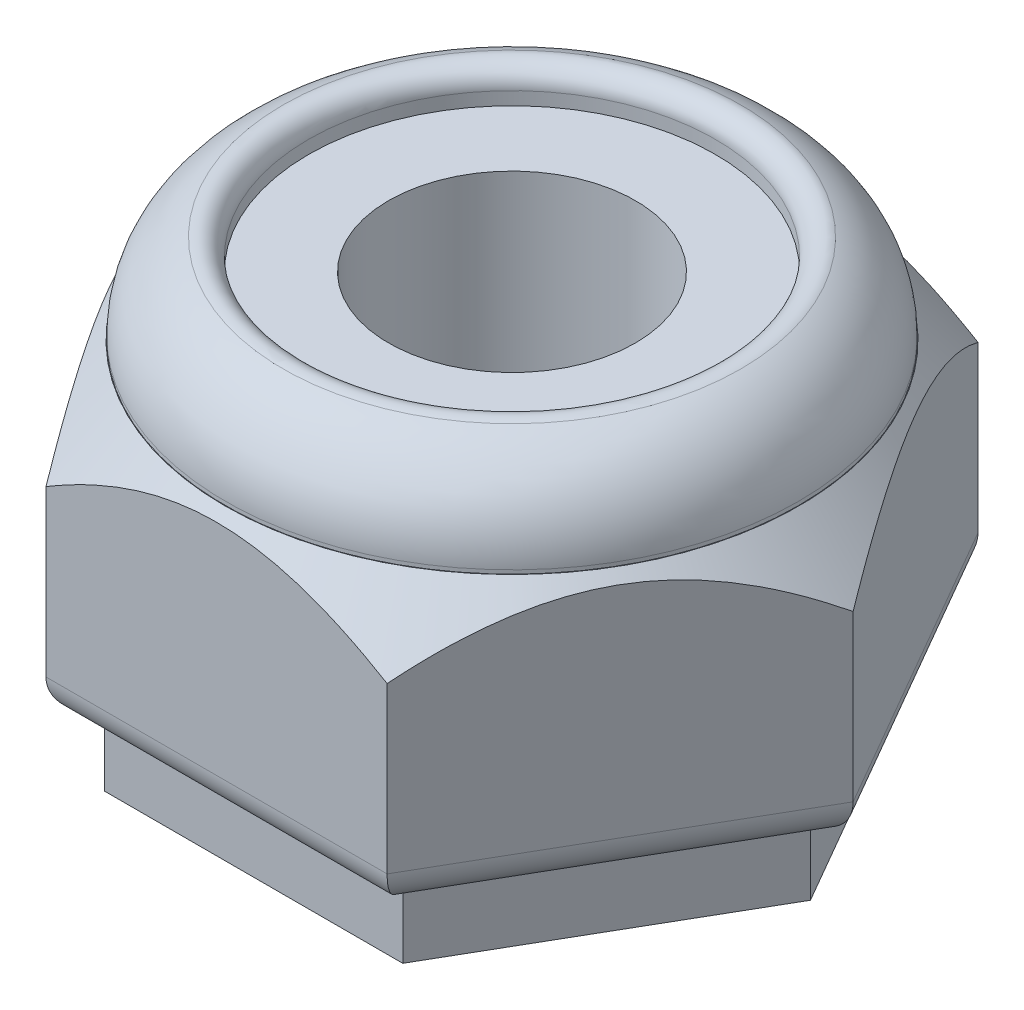
ISO-10303-21;
HEADER;
FILE_DESCRIPTION(('STEP AP214'),'2;1');
FILE_NAME('part.step','',(''),(''),'','','');
FILE_SCHEMA(('AUTOMOTIVE_DESIGN { 1 0 10303 214 1 1 1 1 }'));
ENDSEC;
DATA;
#1=APPLICATION_CONTEXT('core data for automotive mechanical design processes');
#2=APPLICATION_PROTOCOL_DEFINITION('international standard','automotive_design',2000,#1);
#3=PRODUCT_CONTEXT('',#1,'mechanical');
#4=PRODUCT('Part','Part','',(#3));
#5=PRODUCT_RELATED_PRODUCT_CATEGORY('part','',(#4));
#6=PRODUCT_DEFINITION_FORMATION('','',#4);
#7=PRODUCT_DEFINITION_CONTEXT('part definition',#1,'design');
#8=PRODUCT_DEFINITION('design','',#6,#7);
#9=PRODUCT_DEFINITION_SHAPE('','',#8);
#10=(LENGTH_UNIT() NAMED_UNIT(*) SI_UNIT(.MILLI.,.METRE.));
#11=(NAMED_UNIT(*) PLANE_ANGLE_UNIT() SI_UNIT($,.RADIAN.));
#12=(NAMED_UNIT(*) SI_UNIT($,.STERADIAN.) SOLID_ANGLE_UNIT());
#13=UNCERTAINTY_MEASURE_WITH_UNIT(LENGTH_MEASURE(1.E-05),#10,'distance_accuracy_value','');
#14=(GEOMETRIC_REPRESENTATION_CONTEXT(3) GLOBAL_UNCERTAINTY_ASSIGNED_CONTEXT((#13)) GLOBAL_UNIT_ASSIGNED_CONTEXT((#10,
#11,#12)) REPRESENTATION_CONTEXT('',''));
#15=CARTESIAN_POINT('',(0.,0.,0.));
#16=DIRECTION('',(0.,0.,1.));
#17=DIRECTION('',(1.,0.,0.));
#18=AXIS2_PLACEMENT_3D('',#15,#16,#17);
#19=CARTESIAN_POINT('',(0.,4.97840000000001,0.));
#20=DIRECTION('',(0.,-1.,0.));
#21=DIRECTION('',(1.,0.,0.));
#22=AXIS2_PLACEMENT_3D('',#19,#20,#21);
#23=CYLINDRICAL_SURFACE('',#22,3.93700000000001);
#24=CARTESIAN_POINT('',(0.,3.7084,0.));
#25=DIRECTION('',(0.,1.,0.));
#26=DIRECTION('',(-1.,0.,0.));
#27=AXIS2_PLACEMENT_3D('',#24,#25,#26);
#28=CIRCLE('',#27,3.937);
#29=CARTESIAN_POINT('',(-3.937,3.7084,0.));
#30=VERTEX_POINT('',#29);
#31=EDGE_CURVE('E144',#30,#30,#28,.T.);
#32=ORIENTED_EDGE('',*,*,#31,.F.);
#33=EDGE_LOOP('',(#32));
#34=FACE_BOUND('',#33,.T.);
#35=CARTESIAN_POINT('',(0.,3.6576,0.));
#36=DIRECTION('',(0.,-1.,0.));
#37=DIRECTION('',(1.,0.,0.));
#38=AXIS2_PLACEMENT_3D('',#35,#36,#37);
#39=CIRCLE('',#38,3.93700000000001);
#40=CARTESIAN_POINT('',(3.93700000000001,3.6576,0.));
#41=VERTEX_POINT('',#40);
#42=EDGE_CURVE('E22',#41,#41,#39,.F.);
#43=ORIENTED_EDGE('',*,*,#42,.T.);
#44=EDGE_LOOP('',(#43));
#45=FACE_BOUND('',#44,.T.);
#46=ADVANCED_FACE('F18',(#34,#45),#23,.T.);
#47=CARTESIAN_POINT('',(2.34315000000001,3.6576,4.05845484975502));
#48=DIRECTION('',(0.,-1.,0.));
#49=DIRECTION('',(1.,0.,0.));
#50=AXIS2_PLACEMENT_3D('',#47,#48,#49);
#51=PLANE('',#50);
#52=CARTESIAN_POINT('',(0.,3.65760000011051,0.));
#53=DIRECTION('',(0.,-1.,0.));
#54=DIRECTION('',(0.,0.,-1.));
#55=AXIS2_PLACEMENT_3D('',#52,#53,#54);
#56=CIRCLE('',#55,3.94407100941407);
#57=CARTESIAN_POINT('',(0.,3.65760000011051,-3.94407100941407));
#58=VERTEX_POINT('',#57);
#59=EDGE_CURVE('E143',#58,#58,#56,.T.);
#60=ORIENTED_EDGE('',*,*,#59,.F.);
#61=EDGE_LOOP('',(#60));
#62=FACE_BOUND('',#61,.T.);
#63=ORIENTED_EDGE('',*,*,#42,.F.);
#64=EDGE_LOOP('',(#63));
#65=FACE_BOUND('',#64,.T.);
#66=ADVANCED_FACE('F200',(#62,#65),#51,.F.);
#67=CARTESIAN_POINT('',(0.,3.70840000000008,0.));
#68=DIRECTION('',(0.,1.,0.));
#69=DIRECTION('',(0.,0.,1.));
#70=AXIS2_PLACEMENT_3D('',#67,#68,#69);
#71=TOROIDAL_SURFACE('',#70,2.66699999999999,1.27000000000001);
#72=ORIENTED_EDGE('',*,*,#31,.T.);
#73=EDGE_LOOP('',(#72));
#74=FACE_BOUND('',#73,.T.);
#75=CARTESIAN_POINT('',(0.,4.88572150982652,0.));
#76=DIRECTION('',(0.,1.,0.));
#77=DIRECTION('',(-1.,0.,0.));
#78=AXIS2_PLACEMENT_3D('',#75,#76,#77);
#79=CIRCLE('',#78,3.14325000000004);
#80=CARTESIAN_POINT('',(-3.14325000000003,4.88572150982652,0.));
#81=VERTEX_POINT('',#80);
#82=EDGE_CURVE('E123',#81,#81,#79,.T.);
#83=ORIENTED_EDGE('',*,*,#82,.F.);
#84=EDGE_LOOP('',(#83));
#85=FACE_BOUND('',#84,.T.);
#86=ADVANCED_FACE('F197',(#74,#85),#71,.T.);
#87=CARTESIAN_POINT('',(0.,2.76773860957746,0.));
#88=DIRECTION('',(0.,-1.,0.));
#89=DIRECTION('',(0.,0.,-1.));
#90=AXIS2_PLACEMENT_3D('',#87,#88,#89);
#91=CONICAL_SURFACE('',#90,4.69075337400682,0.698131700796127);
#92=CARTESIAN_POINT('',(-4.6863000000114,2.77304593403351,-2.25320317794357E-11));
#93=CARTESIAN_POINT('',(-4.65177717140758,2.81418235893236,0.0597952931420458));
#94=CARTESIAN_POINT('',(-4.61695780287667,2.85432113114669,0.120104208525791));
#95=CARTESIAN_POINT('',(-4.54666264440062,2.93230661024616,0.241858994532976));
#96=CARTESIAN_POINT('',(-4.51118655193285,2.97015222465668,0.303305389140977));
#97=CARTESIAN_POINT('',(-4.40329561884371,3.0801870150367,0.490177966927094));
#98=CARTESIAN_POINT('',(-4.32983334003595,3.14837015579584,0.617418366262069));
#99=CARTESIAN_POINT('',(-4.17977964996728,3.27092778612679,0.877318981324308));
#100=CARTESIAN_POINT('',(-4.10317943932015,3.32525984889778,1.00999443803558));
#101=CARTESIAN_POINT('',(-3.94747591651203,3.41577217649151,1.27968085045666));
#102=CARTESIAN_POINT('',(-3.86837998243798,3.4520014301635,1.41667902694504));
#103=CARTESIAN_POINT('',(-3.73746585196503,3.49372811246488,1.64342895235291));
#104=CARTESIAN_POINT('',(-3.68614686019892,3.50560413718322,1.73231605348501));
#105=CARTESIAN_POINT('',(-3.58316406709111,3.52008140705907,1.91068748345309));
#106=CARTESIAN_POINT('',(-3.53150020834685,3.52268106756209,2.00017191171322));
#107=CARTESIAN_POINT('',(-3.42855034551883,3.51847006527959,2.17848630476359));
#108=CARTESIAN_POINT('',(-3.37726380886124,3.51171021121524,2.26731719199878));
#109=CARTESIAN_POINT('',(-3.27519197709903,3.48921023558751,2.44411079063256));
#110=CARTESIAN_POINT('',(-3.22440670716081,3.47346966545127,2.53207345844164));
#111=CARTESIAN_POINT('',(-3.10963060135703,3.42817062225707,2.7308715051887));
#112=CARTESIAN_POINT('',(-3.0458989957849,3.395985420798,2.84125788408757));
#113=CARTESIAN_POINT('',(-2.92018166741256,3.32004827850177,3.05900668422027));
#114=CARTESIAN_POINT('',(-2.8581969196393,3.27629001419119,3.16636741665791));
#115=CARTESIAN_POINT('',(-2.73588906831862,3.17910361391332,3.3782108293099));
#116=CARTESIAN_POINT('',(-2.67557364740323,3.12563730736463,3.48268020281526));
#117=CARTESIAN_POINT('',(-2.55683004322896,3.01104764614135,3.68835015831895));
#118=CARTESIAN_POINT('',(-2.49840123092182,2.94992687754383,3.78955182986082));
#119=CARTESIAN_POINT('',(-2.42439626094935,2.86741854630126,3.91773219786575));
#120=CARTESIAN_POINT('',(-2.40802320108784,2.84883596653484,3.94609116942125));
#121=CARTESIAN_POINT('',(-2.37546215764895,2.81125673911755,4.00248855100485));
#122=CARTESIAN_POINT('',(-2.35927376443318,2.7922615116575,4.03052767054747));
#123=CARTESIAN_POINT('',(-2.34314999998725,2.77304593403407,4.0584548497771));
#124=B_SPLINE_CURVE_WITH_KNOTS('',3,(#92,#93,#94,#95,#96,#97,#98,#99,#100,#101,#102,#103,#104,
#105,#106,#107,#108,#109,#110,#111,#112,#113,#114,#115,#116,#117,#118,#119,#120,#121,#122,#123),
.UNSPECIFIED.,.F.,.F.,(4,2,2,2,2,2,2,2,2,2,2,2,2,2,2,4),(0.,0.241096809083664,0.482307589442793,
0.967637153828087,1.45443592239967,1.93991010953216,2.24950193429434,2.55914664320212,
2.86711700066345,3.175102742114,3.56882084705011,3.96275452396107,4.35827201922661,
4.75365624670312,4.86660838975017,4.97921936898528),.UNSPECIFIED.);
#125=CARTESIAN_POINT('',(-4.68630000001355,2.77304593403312,1.36271423806302E-12));
#126=VERTEX_POINT('',#125);
#127=CARTESIAN_POINT('',(-2.34314999999362,2.77304593404168,4.05845484976606));
#128=VERTEX_POINT('',#127);
#129=EDGE_CURVE('E109',#126,#128,#124,.T.);
#130=ORIENTED_EDGE('',*,*,#129,.T.);
#131=CARTESIAN_POINT('',(-2.34315000002808,2.77304593403118,4.05845484975238));
#132=CARTESIAN_POINT('',(-2.27415972167844,2.81414935275283,4.05845484975403));
#133=CARTESIAN_POINT('',(-2.20457738519557,2.85425669888465,4.05845484975473));
#134=CARTESIAN_POINT('',(-2.06410193525847,2.93218331971731,4.05845484975526));
#135=CARTESIAN_POINT('',(-1.99320821639063,2.97000150134924,4.05845484975509));
#136=CARTESIAN_POINT('',(-1.77754688770801,3.0799908638983,4.05845484975481));
#137=CARTESIAN_POINT('',(-1.63068545868604,3.1481589404029,4.05845484975493));
#138=CARTESIAN_POINT('',(-1.3305275245716,3.27077676922337,4.05845484975507));
#139=CARTESIAN_POINT('',(-1.17720631608808,3.32516696807218,4.05845484975508));
#140=CARTESIAN_POINT('',(-0.865613503807899,3.41574608769028,4.05845484975491));
#141=CARTESIAN_POINT('',(-0.70735922931479,3.45199244877867,4.05845484975473));
#142=CARTESIAN_POINT('',(-0.456822143349791,3.49192146549892,4.05845484975515));
#143=CARTESIAN_POINT('',(-0.365672921159959,3.50290887298616,4.05845484975545));
#144=CARTESIAN_POINT('',(-0.183016322006344,3.51758027916804,4.05845484975455));
#145=CARTESIAN_POINT('',(-0.0915105175260117,3.52128341040286,4.05845484975336));
#146=CARTESIAN_POINT('',(0.104649468641685,3.52128177495004,4.05845484975317));
#147=CARTESIAN_POINT('',(0.209305100872509,3.51643705336781,4.05845484975451));
#148=CARTESIAN_POINT('',(0.4177871819109,3.49730239563263,4.05845484975549));
#149=CARTESIAN_POINT('',(0.521613181354208,3.48300765114723,4.05845484975513));
#150=CARTESIAN_POINT('',(0.728332544915475,3.44553375889264,4.05845484975487));
#151=CARTESIAN_POINT('',(0.831215331560758,3.42229697727172,4.05845484975496));
#152=CARTESIAN_POINT('',(1.03487580391396,3.36791830057568,4.05845484975503));
#153=CARTESIAN_POINT('',(1.13565289469103,3.33677420324552,4.05845484975501));
#154=CARTESIAN_POINT('',(1.33273383822212,3.2683874192087,4.05845484975499));
#155=CARTESIAN_POINT('',(1.42908716225822,3.23128582687484,4.058454849755));
#156=CARTESIAN_POINT('',(1.61947291707581,3.1515107159495,4.058454849755));
#157=CARTESIAN_POINT('',(1.71350470708827,3.10883567902456,4.058454849755));
#158=CARTESIAN_POINT('',(1.89803195380911,3.01941532334896,4.058454849755));
#159=CARTESIAN_POINT('',(1.98855798044697,2.97273255729397,4.058454849755));
#160=CARTESIAN_POINT('',(2.16742834955933,2.87556944088041,4.058454849755));
#161=CARTESIAN_POINT('',(2.25577492889981,2.82509321935966,4.058454849755));
#162=CARTESIAN_POINT('',(2.3431500000285,2.7730459340323,4.058454849755));
#163=B_SPLINE_CURVE_WITH_KNOTS('',3,(#131,#132,#133,#134,#135,#136,#137,#138,#139,#140,#141,
#142,#143,#144,#145,#146,#147,#148,#149,#150,#151,#152,#153,#154,#155,#156,#157,#158,#159,#160,
#161,#162),.UNSPECIFIED.,.F.,.F.,(4,2,2,2,2,2,2,2,2,2,2,2,2,2,2,4),(0.,0.240903303554711,
0.481920744726708,0.967059466949703,1.45426068372302,1.93990959173642,2.2150793469257,
2.4895253838648,2.80337599593601,3.11738642357659,3.43345557969779,3.74961286052927,
4.05916118103853,4.36879400616134,4.67425708540958,4.97939238062303),.UNSPECIFIED.);
#164=CARTESIAN_POINT('',(2.34315000000798,2.77304593403312,4.05845484976606));
#165=VERTEX_POINT('',#164);
#166=EDGE_CURVE('E177',#128,#165,#163,.T.);
#167=ORIENTED_EDGE('',*,*,#166,.T.);
#168=CARTESIAN_POINT('',(2.34314999998621,2.77304593403353,4.05845484977614));
#169=CARTESIAN_POINT('',(2.37767282859156,2.81418235893238,3.99865955661244));
#170=CARTESIAN_POINT('',(2.41249219712311,2.8543211311467,3.93835064122907));
#171=CARTESIAN_POINT('',(2.48278735559964,2.93230661024616,3.81659585522216));
#172=CARTESIAN_POINT('',(2.51826344806725,2.97015222465669,3.75514946061407));
#173=CARTESIAN_POINT('',(2.62615438115614,3.08018701503671,3.56827688282781));
#174=CARTESIAN_POINT('',(2.69961665996402,3.14837015579585,3.44103648349291));
#175=CARTESIAN_POINT('',(2.84967035003279,3.27092778612679,3.18113586843073));
#176=CARTESIAN_POINT('',(2.92627056067988,3.32525984889778,3.04846041171944));
#177=CARTESIAN_POINT('',(3.08197408348797,3.41577217649151,2.77877399929834));
#178=CARTESIAN_POINT('',(3.16107001756203,3.4520014301635,2.64177582280997));
#179=CARTESIAN_POINT('',(3.29198414803499,3.49372811246488,2.4150258974021));
#180=CARTESIAN_POINT('',(3.34330313980109,3.50560413718322,2.32613879627));
#181=CARTESIAN_POINT('',(3.4462859329089,3.52008140705907,2.14776736630192));
#182=CARTESIAN_POINT('',(3.49794979165316,3.52268106756208,2.05828293804179));
#183=CARTESIAN_POINT('',(3.60089965448118,3.51847006527958,1.87996854499142));
#184=CARTESIAN_POINT('',(3.65218619113878,3.51171021121523,1.79113765775623));
#185=CARTESIAN_POINT('',(3.75425802290099,3.4892102355875,1.61434405912245));
#186=CARTESIAN_POINT('',(3.8050432928392,3.47346966545127,1.52638139131337));
#187=CARTESIAN_POINT('',(3.91981939864298,3.42817062225706,1.32758334456632));
#188=CARTESIAN_POINT('',(3.98355100421511,3.395985420798,1.21719696566744));
#189=CARTESIAN_POINT('',(4.10926833258744,3.32004827850177,0.999448165534749));
#190=CARTESIAN_POINT('',(4.1712530803607,3.27629001419119,0.892087433097115));
#191=CARTESIAN_POINT('',(4.29356093168138,3.17910361391333,0.680244020445119));
#192=CARTESIAN_POINT('',(4.35387635259678,3.12563730736463,0.575774646939759));
#193=CARTESIAN_POINT('',(4.47261995677105,3.01104764614134,0.370104691436063));
#194=CARTESIAN_POINT('',(4.53104876907819,2.94992687754382,0.268903019894197));
#195=CARTESIAN_POINT('',(4.60505373905119,2.86741854630066,0.140722651888345));
#196=CARTESIAN_POINT('',(4.62142679891323,2.84883596653364,0.112363680331929));
#197=CARTESIAN_POINT('',(4.65398784235315,2.81125673911511,0.0559662987465316));
#198=CARTESIAN_POINT('',(4.67017623556943,2.79226151165442,0.0279271792030216));
#199=CARTESIAN_POINT('',(4.68630000001588,2.77304593403035,-2.74892354372029E-11));
#200=B_SPLINE_CURVE_WITH_KNOTS('',3,(#168,#169,#170,#171,#172,#173,#174,#175,#176,#177,#178,
#179,#180,#181,#182,#183,#184,#185,#186,#187,#188,#189,#190,#191,#192,#193,#194,#195,#196,#197,
#198,#199),.UNSPECIFIED.,.F.,.F.,(4,2,2,2,2,2,2,2,2,2,2,2,2,2,2,4),(0.,0.24109680908366,
0.482307589442785,0.967637153828072,1.45443592239965,1.93991010953214,2.24950193429432,
2.5591466432021,2.86711700066343,3.17510274211398,3.56882084705008,3.96275452396103,
4.35827201922658,4.7536562467031,4.86660838975378,4.97921936899252),.UNSPECIFIED.);
#201=CARTESIAN_POINT('',(4.68630000000959,2.77304593403784,-1.09177533815339E-11));
#202=VERTEX_POINT('',#201);
#203=EDGE_CURVE('E184',#165,#202,#200,.T.);
#204=ORIENTED_EDGE('',*,*,#203,.T.);
#205=CARTESIAN_POINT('',(4.6863000000077,2.77304593404706,4.30696082311977E-12));
#206=CARTESIAN_POINT('',(4.65177717140048,2.81418235894394,-0.0597952931587288));
#207=CARTESIAN_POINT('',(4.61695780286828,2.85432113115712,-0.12010420854158));
#208=CARTESIAN_POINT('',(4.54666264439155,2.9323066102551,-0.241858994547573));
#209=CARTESIAN_POINT('',(4.5111865519244,2.97015222466526,-0.303305389155276));
#210=CARTESIAN_POINT('',(4.40329561883659,3.08018701504403,-0.490177966940317));
#211=CARTESIAN_POINT('',(4.32983334002904,3.14837015580208,-0.617418366274323));
#212=CARTESIAN_POINT('',(4.17977964996121,3.27092778613112,-0.877318981334661));
#213=CARTESIAN_POINT('',(4.10317943931471,3.3252598489013,-1.009994438045));
#214=CARTESIAN_POINT('',(3.94747591650782,3.41577217649357,-1.27968085046408));
#215=CARTESIAN_POINT('',(3.86837998243436,3.45200143016491,-1.4166790269514));
#216=CARTESIAN_POINT('',(3.73746585196203,3.49372811246563,-1.64342895235816));
#217=CARTESIAN_POINT('',(3.68614686019593,3.50560413718379,-1.73231605349025));
#218=CARTESIAN_POINT('',(3.58316406708815,3.52008140705927,-1.91068748345829));
#219=CARTESIAN_POINT('',(3.5315002083439,3.52268106756211,-2.00017191171839));
#220=CARTESIAN_POINT('',(3.42855034551591,3.51847006527925,-2.17848630476871));
#221=CARTESIAN_POINT('',(3.37726380885834,3.51171021121472,-2.26731719200387));
#222=CARTESIAN_POINT('',(3.27519197709618,3.48921023558666,-2.44411079063756));
#223=CARTESIAN_POINT('',(3.22440670715799,3.47346966545027,-2.5320734584466));
#224=CARTESIAN_POINT('',(3.10963060135412,3.42817062225566,-2.73087150519382));
#225=CARTESIAN_POINT('',(3.04589899578186,3.39598542079632,-2.84125788409289));
#226=CARTESIAN_POINT('',(2.92018166740931,3.32004827849954,-3.05900668422598));
#227=CARTESIAN_POINT('',(2.85819691963594,3.27629001418867,-3.16636741666379));
#228=CARTESIAN_POINT('',(2.73588906831506,3.17910361391023,-3.37821082931613));
#229=CARTESIAN_POINT('',(2.67557364739958,3.12563730736124,-3.48268020282165));
#230=CARTESIAN_POINT('',(2.55683004322512,3.01104764613738,-3.68835015832566));
#231=CARTESIAN_POINT('',(2.4984012309179,2.94992687753957,-3.78955182986768));
#232=CARTESIAN_POINT('',(2.42439626094576,2.86741854629714,-3.91773219787203));
#233=CARTESIAN_POINT('',(2.40802320108466,2.84883596653115,-3.94609116942682));
#234=CARTESIAN_POINT('',(2.37546215764661,2.81125673911474,-4.00248855100899));
#235=CARTESIAN_POINT('',(2.35927376443124,2.79226151165513,-4.03052767055091));
#236=CARTESIAN_POINT('',(2.34314999998571,2.77304593403217,-4.05845484977984));
#237=B_SPLINE_CURVE_WITH_KNOTS('',3,(#205,#206,#207,#208,#209,#210,#211,#212,#213,#214,#215,
#216,#217,#218,#219,#220,#221,#222,#223,#224,#225,#226,#227,#228,#229,#230,#231,#232,#233,#234,
#235,#236),.UNSPECIFIED.,.F.,.F.,(4,2,2,2,2,2,2,2,2,2,2,2,2,2,2,4),(0.,0.241096809081634,
0.482307589438773,0.967637153820102,1.45443592238771,1.93991010951624,2.24950193427831,
2.55914664318599,2.86711700064724,3.1751027420977,3.56882084703468,3.96275452394652,
4.35827201921293,4.75365624669031,4.86660838973455,4.97921936896688),.UNSPECIFIED.);
#238=CARTESIAN_POINT('',(2.34315000000562,2.77304593403307,-4.05845484976747));
#239=VERTEX_POINT('',#238);
#240=EDGE_CURVE('E204',#202,#239,#237,.T.);
#241=ORIENTED_EDGE('',*,*,#240,.T.);
#242=CARTESIAN_POINT('',(2.34315000002522,2.77304593403346,-4.05845484975367));
#243=CARTESIAN_POINT('',(2.27415972167548,2.81414935275472,-4.05845484975455));
#244=CARTESIAN_POINT('',(2.20457738519261,2.85425669888632,-4.05845484975493));
#245=CARTESIAN_POINT('',(2.06410193525561,2.93218331971872,-4.05845484975521));
#246=CARTESIAN_POINT('',(1.99320821638787,2.97000150135059,-4.05845484975512));
#247=CARTESIAN_POINT('',(1.7775468877055,3.07999086389946,-4.05845484975497));
#248=CARTESIAN_POINT('',(1.63068545868367,3.14815894040388,-4.05845484975502));
#249=CARTESIAN_POINT('',(1.33052752456956,3.27077676922404,-4.05845484975511));
#250=CARTESIAN_POINT('',(1.17720631608622,3.32516696807271,-4.05845484975515));
#251=CARTESIAN_POINT('',(0.8656135038064,3.41574608769057,-4.05845484975499));
#252=CARTESIAN_POINT('',(0.707359229313482,3.45199244877884,-4.0584548497548));
#253=CARTESIAN_POINT('',(0.456822143348863,3.49192146549896,-4.05845484975522));
#254=CARTESIAN_POINT('',(0.365672921159217,3.50290887298615,-4.05845484975552));
#255=CARTESIAN_POINT('',(0.183016322005974,3.51758027916796,-4.05845484975462));
#256=CARTESIAN_POINT('',(0.0915105175258283,3.52128341040278,-4.05845484975343));
#257=CARTESIAN_POINT('',(-0.104649468641683,3.52128177494995,-4.05845484975323));
#258=CARTESIAN_POINT('',(-0.209305100872509,3.51643705336773,-4.05845484975458));
#259=CARTESIAN_POINT('',(-0.417787181910904,3.49730239563255,-4.05845484975556));
#260=CARTESIAN_POINT('',(-0.521613181354215,3.48300765114714,-4.0584548497552));
#261=CARTESIAN_POINT('',(-0.728332544915485,3.44553375889256,-4.05845484975494));
#262=CARTESIAN_POINT('',(-0.831215331560771,3.42229697727164,-4.05845484975503));
#263=CARTESIAN_POINT('',(-1.03487580391397,3.3679183005756,-4.0584548497551));
#264=CARTESIAN_POINT('',(-1.13565289469105,3.33677420324543,-4.05845484975508));
#265=CARTESIAN_POINT('',(-1.33273383822213,3.26838741920861,-4.05845484975506));
#266=CARTESIAN_POINT('',(-1.42908716225822,3.23128582687476,-4.05845484975507));
#267=CARTESIAN_POINT('',(-1.61947291707579,3.15151071594942,-4.05845484975507));
#268=CARTESIAN_POINT('',(-1.71350470708825,3.10883567902449,-4.05845484975507));
#269=CARTESIAN_POINT('',(-1.89803195380907,3.01941532334891,-4.05845484975507));
#270=CARTESIAN_POINT('',(-1.98855798044692,2.97273255729392,-4.05845484975507));
#271=CARTESIAN_POINT('',(-2.16742834955927,2.87556944088037,-4.05845484975507));
#272=CARTESIAN_POINT('',(-2.25577492889974,2.82509321935963,-4.05845484975507));
#273=CARTESIAN_POINT('',(-2.34315000002843,2.77304593403228,-4.05845484975507));
#274=B_SPLINE_CURVE_WITH_KNOTS('',3,(#242,#243,#244,#245,#246,#247,#248,#249,#250,#251,#252,
#253,#254,#255,#256,#257,#258,#259,#260,#261,#262,#263,#264,#265,#266,#267,#268,#269,#270,#271,
#272,#273),.UNSPECIFIED.,.F.,.F.,(4,2,2,2,2,2,2,2,2,2,2,2,2,2,2,4),(0.,0.240903303554384,
0.481920744726062,0.967059466948426,1.45426068372112,1.93990959173388,2.2150793469226,
2.48952538386114,2.80337599593235,3.11738642357295,3.43345557969415,3.74961286052563,
4.05916118103487,4.36879400615765,4.67425708540586,4.97939238061928),.UNSPECIFIED.);
#275=CARTESIAN_POINT('',(-2.34315000000792,2.77304593403309,-4.05845484976612));
#276=VERTEX_POINT('',#275);
#277=EDGE_CURVE('E112',#239,#276,#274,.T.);
#278=ORIENTED_EDGE('',*,*,#277,.T.);
#279=CARTESIAN_POINT('',(-2.34314999998617,2.77304593403349,-4.0584548497762));
#280=CARTESIAN_POINT('',(-2.37767282859151,2.81418235893234,-3.9986595566125));
#281=CARTESIAN_POINT('',(-2.41249219712307,2.85432113114667,-3.93835064122912));
#282=CARTESIAN_POINT('',(-2.4827873555996,2.93230661024614,-3.81659585522221));
#283=CARTESIAN_POINT('',(-2.51826344806721,2.97015222465667,-3.75514946061412));
#284=CARTESIAN_POINT('',(-2.6261543811561,3.08018701503669,-3.56827688282785));
#285=CARTESIAN_POINT('',(-2.69961665996399,3.14837015579583,-3.44103648349295));
#286=CARTESIAN_POINT('',(-2.84967035003276,3.27092778612678,-3.18113586843076));
#287=CARTESIAN_POINT('',(-2.92627056067985,3.32525984889778,-3.04846041171947));
#288=CARTESIAN_POINT('',(-3.08197408348795,3.41577217649151,-2.77877399929836));
#289=CARTESIAN_POINT('',(-3.16107001756201,3.4520014301635,-2.64177582280998));
#290=CARTESIAN_POINT('',(-3.29198414803497,3.49372811246489,-2.41502589740211));
#291=CARTESIAN_POINT('',(-3.34330313980108,3.50560413718323,-2.32613879627001));
#292=CARTESIAN_POINT('',(-3.44628593290889,3.52008140705908,-2.14776736630193));
#293=CARTESIAN_POINT('',(-3.49794979165315,3.52268106756209,-2.0582829380418));
#294=CARTESIAN_POINT('',(-3.60089965448117,3.51847006527959,-1.87996854499143));
#295=CARTESIAN_POINT('',(-3.65218619113876,3.51171021121524,-1.79113765775624));
#296=CARTESIAN_POINT('',(-3.75425802290097,3.48921023558751,-1.61434405912246));
#297=CARTESIAN_POINT('',(-3.80504329283918,3.47346966545127,-1.52638139131338));
#298=CARTESIAN_POINT('',(-3.91981939864297,3.42817062225707,-1.32758334456633));
#299=CARTESIAN_POINT('',(-3.9835510042151,3.39598542079801,-1.21719696566745));
#300=CARTESIAN_POINT('',(-4.10926833258743,3.32004827850178,-0.999448165534755));
#301=CARTESIAN_POINT('',(-4.17125308036069,3.2762900141912,-0.892087433097121));
#302=CARTESIAN_POINT('',(-4.29356093168137,3.17910361391333,-0.680244020445125));
#303=CARTESIAN_POINT('',(-4.35387635259676,3.12563730736464,-0.575774646939767));
#304=CARTESIAN_POINT('',(-4.47261995677104,3.01104764614136,-0.370104691436074));
#305=CARTESIAN_POINT('',(-4.53104876907817,2.94992687754383,-0.26890301989421));
#306=CARTESIAN_POINT('',(-4.60505373905091,2.86741854630097,-0.140722651888813));
#307=CARTESIAN_POINT('',(-4.62142679891269,2.84883596653424,-0.112363680332845));
#308=CARTESIAN_POINT('',(-4.6539878423521,2.81125673911633,-0.0559662987483338));
#309=CARTESIAN_POINT('',(-4.67017623556813,2.79226151165595,-0.0279271792052623));
#310=CARTESIAN_POINT('',(-4.68630000001432,2.7730459340322,2.48135795039542E-11));
#311=B_SPLINE_CURVE_WITH_KNOTS('',3,(#279,#280,#281,#282,#283,#284,#285,#286,#287,#288,#289,
#290,#291,#292,#293,#294,#295,#296,#297,#298,#299,#300,#301,#302,#303,#304,#305,#306,#307,#308,
#309,#310),.UNSPECIFIED.,.F.,.F.,(4,2,2,2,2,2,2,2,2,2,2,2,2,2,2,4),(0.,0.241096809083669,
0.482307589442803,0.967637153828107,1.4544359223997,1.93991010953221,2.24950193429439,
2.55914664320217,2.8671170006635,3.17510274211405,3.56882084705015,3.96275452396111,
4.35827201922665,4.75365624670316,4.86660838975205,4.979219368989),.UNSPECIFIED.);
#312=EDGE_CURVE('E105',#276,#126,#311,.T.);
#313=ORIENTED_EDGE('',*,*,#312,.T.);
#314=EDGE_LOOP('',(#130,#167,#204,#241,#278,#313));
#315=FACE_BOUND('',#314,.T.);
#316=ORIENTED_EDGE('',*,*,#59,.T.);
#317=EDGE_LOOP('',(#316));
#318=FACE_BOUND('',#317,.T.);
#319=ADVANCED_FACE('F107',(#315,#318),#91,.T.);
#320=CARTESIAN_POINT('',(0.,4.65025720786122,0.));
#321=DIRECTION('',(0.,-1.,0.));
#322=DIRECTION('',(1.,0.,0.));
#323=AXIS2_PLACEMENT_3D('',#320,#321,#322);
#324=TOROIDAL_SURFACE('',#323,3.04800000000006,0.254);
#325=CARTESIAN_POINT('',(0.,4.65025720786115,0.));
#326=DIRECTION('',(0.,1.,0.));
#327=DIRECTION('',(-1.,0.,0.));
#328=AXIS2_PLACEMENT_3D('',#325,#326,#327);
#329=CIRCLE('',#328,2.79400000000001);
#330=CARTESIAN_POINT('',(-2.79400000000001,4.65025720786115,0.));
#331=VERTEX_POINT('',#330);
#332=EDGE_CURVE('E136',#331,#331,#329,.F.);
#333=ORIENTED_EDGE('',*,*,#332,.T.);
#334=EDGE_LOOP('',(#333));
#335=FACE_BOUND('',#334,.T.);
#336=ORIENTED_EDGE('',*,*,#82,.T.);
#337=EDGE_LOOP('',(#336));
#338=FACE_BOUND('',#337,.T.);
#339=ADVANCED_FACE('F20',(#335,#338),#324,.T.);
#340=CARTESIAN_POINT('',(-4.6863,3.6576,0.));
#341=DIRECTION('',(0.866025403784439,0.,-0.5));
#342=DIRECTION('',(-0.5,0.,-0.866025403784439));
#343=AXIS2_PLACEMENT_3D('',#340,#341,#342);
#344=PLANE('',#343);
#345=DIRECTION('',(0.,1.,0.));
#346=VECTOR('',#345,1.);
#347=CARTESIAN_POINT('',(-2.34315,3.6576,4.058454849755));
#348=LINE('',#347,#346);
#349=CARTESIAN_POINT('',(-2.34315000000001,0.507999999999995,4.05845484975499));
#350=VERTEX_POINT('',#349);
#351=EDGE_CURVE('E122',#350,#128,#348,.T.);
#352=ORIENTED_EDGE('',*,*,#351,.T.);
#353=ORIENTED_EDGE('',*,*,#129,.F.);
#354=DIRECTION('',(0.,1.,0.));
#355=VECTOR('',#354,1.);
#356=CARTESIAN_POINT('',(-4.6863000000071,3.6576,1.22922505507717E-11));
#357=LINE('',#356,#355);
#358=CARTESIAN_POINT('',(-4.68630000000355,0.507999999999995,6.14200530713038E-12));
#359=VERTEX_POINT('',#358);
#360=EDGE_CURVE('E116',#126,#359,#357,.F.);
#361=ORIENTED_EDGE('',*,*,#360,.T.);
#362=DIRECTION('',(-0.5,0.,-0.866025403784439));
#363=VECTOR('',#362,1.);
#364=CARTESIAN_POINT('',(-4.68630000000001,0.507999999999995,0.));
#365=LINE('',#364,#363);
#366=EDGE_CURVE('E139',#350,#359,#365,.T.);
#367=ORIENTED_EDGE('',*,*,#366,.F.);
#368=EDGE_LOOP('',(#352,#353,#361,#367));
#369=FACE_BOUND('',#368,.T.);
#370=ADVANCED_FACE('F119',(#369),#344,.F.);
#371=CARTESIAN_POINT('',(-2.34315,3.6576,-4.05845484975501));
#372=DIRECTION('',(0.866025403784439,0.,0.5));
#373=DIRECTION('',(0.5,0.,-0.866025403784439));
#374=AXIS2_PLACEMENT_3D('',#371,#372,#373);
#375=PLANE('',#374);
#376=ORIENTED_EDGE('',*,*,#360,.F.);
#377=ORIENTED_EDGE('',*,*,#312,.F.);
#378=DIRECTION('',(0.,1.,0.));
#379=VECTOR('',#378,1.);
#380=CARTESIAN_POINT('',(-2.34315000001417,3.6576,-4.05845484975507));
#381=LINE('',#380,#379);
#382=CARTESIAN_POINT('',(-2.34315000000708,0.507999999999994,-4.05845484975504));
#383=VERTEX_POINT('',#382);
#384=EDGE_CURVE('E131',#276,#383,#381,.F.);
#385=ORIENTED_EDGE('',*,*,#384,.T.);
#386=DIRECTION('',(0.5,0.,-0.866025403784439));
#387=VECTOR('',#386,1.);
#388=CARTESIAN_POINT('',(-2.34315,0.507999999999995,-4.05845484975502));
#389=LINE('',#388,#387);
#390=EDGE_CURVE('E128',#359,#383,#389,.T.);
#391=ORIENTED_EDGE('',*,*,#390,.F.);
#392=EDGE_LOOP('',(#376,#377,#385,#391));
#393=FACE_BOUND('',#392,.T.);
#394=ADVANCED_FACE('F126',(#393),#375,.F.);
#395=CARTESIAN_POINT('',(2.34315000000001,3.6576,-4.05845484975507));
#396=DIRECTION('',(0.,0.,1.));
#397=DIRECTION('',(1.,0.,0.));
#398=AXIS2_PLACEMENT_3D('',#395,#396,#397);
#399=PLANE('',#398);
#400=ORIENTED_EDGE('',*,*,#384,.F.);
#401=ORIENTED_EDGE('',*,*,#277,.F.);
#402=DIRECTION('',(0.,1.,0.));
#403=VECTOR('',#402,1.);
#404=CARTESIAN_POINT('',(2.34314999999293,3.6576,-4.05845484976733));
#405=LINE('',#404,#403);
#406=CARTESIAN_POINT('',(2.34314999999648,0.507999999999998,-4.05845484976118));
#407=VERTEX_POINT('',#406);
#408=EDGE_CURVE('E445',#239,#407,#405,.F.);
#409=ORIENTED_EDGE('',*,*,#408,.T.);
#410=DIRECTION('',(1.,0.,0.));
#411=VECTOR('',#410,1.);
#412=CARTESIAN_POINT('',(2.34315,0.507999999999994,-4.05845484975503));
#413=LINE('',#412,#411);
#414=EDGE_CURVE('E171',#383,#407,#413,.T.);
#415=ORIENTED_EDGE('',*,*,#414,.F.);
#416=EDGE_LOOP('',(#400,#401,#409,#415));
#417=FACE_BOUND('',#416,.T.);
#418=ADVANCED_FACE('F343',(#417),#399,.F.);
#419=CARTESIAN_POINT('',(4.68630000000002,3.6576,0.));
#420=DIRECTION('',(-0.866025403784439,0.,0.5));
#421=DIRECTION('',(0.5,0.,0.866025403784439));
#422=AXIS2_PLACEMENT_3D('',#419,#420,#421);
#423=PLANE('',#422);
#424=ORIENTED_EDGE('',*,*,#408,.F.);
#425=ORIENTED_EDGE('',*,*,#240,.F.);
#426=DIRECTION('',(0.,1.,0.));
#427=VECTOR('',#426,1.);
#428=CARTESIAN_POINT('',(4.68630000001422,3.6576,-2.46174608475869E-11));
#429=LINE('',#428,#427);
#430=CARTESIAN_POINT('',(4.68630000000712,0.508000000000008,-1.23197486283713E-11));
#431=VERTEX_POINT('',#430);
#432=EDGE_CURVE('E437',#202,#431,#429,.F.);
#433=ORIENTED_EDGE('',*,*,#432,.T.);
#434=DIRECTION('',(0.5,0.,0.866025403784439));
#435=VECTOR('',#434,1.);
#436=CARTESIAN_POINT('',(4.68630000000002,0.507999999999995,0.));
#437=LINE('',#436,#435);
#438=EDGE_CURVE('E167',#407,#431,#437,.T.);
#439=ORIENTED_EDGE('',*,*,#438,.F.);
#440=EDGE_LOOP('',(#424,#425,#433,#439));
#441=FACE_BOUND('',#440,.T.);
#442=ADVANCED_FACE('F349',(#441),#423,.F.);
#443=CARTESIAN_POINT('',(2.34315000000001,3.6576,4.05845484975502));
#444=DIRECTION('',(-0.866025403784439,0.,-0.499999999999999));
#445=DIRECTION('',(-0.499999999999999,0.,0.866025403784439));
#446=AXIS2_PLACEMENT_3D('',#443,#444,#445);
#447=PLANE('',#446);
#448=ORIENTED_EDGE('',*,*,#432,.F.);
#449=ORIENTED_EDGE('',*,*,#203,.F.);
#450=DIRECTION('',(0.,1.,0.));
#451=VECTOR('',#450,1.);
#452=CARTESIAN_POINT('',(2.34315000001423,3.6576,4.058454849755));
#453=LINE('',#452,#451);
#454=CARTESIAN_POINT('',(2.34315000000713,0.507999999999995,4.05845484975499));
#455=VERTEX_POINT('',#454);
#456=EDGE_CURVE('E140',#165,#455,#453,.F.);
#457=ORIENTED_EDGE('',*,*,#456,.T.);
#458=DIRECTION('',(-0.499999999999999,0.,0.866025403784439));
#459=VECTOR('',#458,1.);
#460=CARTESIAN_POINT('',(2.34315000000003,0.508000000000008,4.05845484975498));
#461=LINE('',#460,#459);
#462=EDGE_CURVE('E163',#431,#455,#461,.T.);
#463=ORIENTED_EDGE('',*,*,#462,.F.);
#464=EDGE_LOOP('',(#448,#449,#457,#463));
#465=FACE_BOUND('',#464,.T.);
#466=ADVANCED_FACE('F303',(#465),#447,.F.);
#467=CARTESIAN_POINT('',(-2.34315000000002,3.6576,4.058454849755));
#468=DIRECTION('',(0.,0.,-1.));
#469=DIRECTION('',(-1.,0.,0.));
#470=AXIS2_PLACEMENT_3D('',#467,#468,#469);
#471=PLANE('',#470);
#472=ORIENTED_EDGE('',*,*,#456,.F.);
#473=ORIENTED_EDGE('',*,*,#166,.F.);
#474=ORIENTED_EDGE('',*,*,#351,.F.);
#475=DIRECTION('',(-1.,0.,0.));
#476=VECTOR('',#475,1.);
#477=CARTESIAN_POINT('',(-2.34315,0.507999999999995,4.05845484975498));
#478=LINE('',#477,#476);
#479=EDGE_CURVE('E159',#455,#350,#478,.T.);
#480=ORIENTED_EDGE('',*,*,#479,.F.);
#481=EDGE_LOOP('',(#472,#473,#474,#480));
#482=FACE_BOUND('',#481,.T.);
#483=ADVANCED_FACE('F190',(#482),#471,.F.);
#484=CARTESIAN_POINT('',(0.,4.4704,0.));
#485=DIRECTION('',(0.,1.,0.));
#486=DIRECTION('',(-1.,0.,0.));
#487=AXIS2_PLACEMENT_3D('',#484,#485,#486);
#488=CYLINDRICAL_SURFACE('',#487,2.79400000000001);
#489=ORIENTED_EDGE('',*,*,#332,.F.);
#490=EDGE_LOOP('',(#489));
#491=FACE_BOUND('',#490,.T.);
#492=CARTESIAN_POINT('',(0.,4.4704,0.));
#493=DIRECTION('',(0.,1.,0.));
#494=DIRECTION('',(-1.,0.,0.));
#495=AXIS2_PLACEMENT_3D('',#492,#493,#494);
#496=CIRCLE('',#495,2.79400000000001);
#497=CARTESIAN_POINT('',(-2.79400000000001,4.4704,0.));
#498=VERTEX_POINT('',#497);
#499=EDGE_CURVE('E152',#498,#498,#496,.T.);
#500=ORIENTED_EDGE('',*,*,#499,.F.);
#501=EDGE_LOOP('',(#500));
#502=FACE_BOUND('',#501,.T.);
#503=ADVANCED_FACE('F296',(#491,#502),#488,.F.);
#504=CARTESIAN_POINT('',(-4.24635909487751,0.507999999999995,-0.254000000000011));
#505=DIRECTION('',(-0.5,0.,-0.866025403784439));
#506=DIRECTION('',(-0.866025403784439,0.,0.5));
#507=AXIS2_PLACEMENT_3D('',#504,#505,#506);
#508=CYLINDRICAL_SURFACE('',#507,0.508000000000002);
#509=CARTESIAN_POINT('',(-4.09971212650334,0.507999999999995,0.));
#510=DIRECTION('',(0.,0.,-1.));
#511=DIRECTION('',(1.,0.,0.));
#512=AXIS2_PLACEMENT_3D('',#509,#510,#511);
#513=ELLIPSE('',#512,0.586587873496662,0.508000000000002);
#514=CARTESIAN_POINT('',(-4.09971212650335,0.,0.));
#515=VERTEX_POINT('',#514);
#516=EDGE_CURVE('E175',#515,#359,#513,.T.);
#517=ORIENTED_EDGE('',*,*,#516,.F.);
#518=DIRECTION('',(-0.5,0.,-0.866025403784439));
#519=VECTOR('',#518,1.);
#520=CARTESIAN_POINT('',(-2.04985606325168,0.,3.55045484975499));
#521=LINE('',#520,#519);
#522=CARTESIAN_POINT('',(-2.04985606325168,0.,3.55045484975498));
#523=VERTEX_POINT('',#522);
#524=EDGE_CURVE('E155',#515,#523,#521,.F.);
#525=ORIENTED_EDGE('',*,*,#524,.T.);
#526=CARTESIAN_POINT('',(-2.04985606325169,0.507999999999995,3.55045484975498));
#527=DIRECTION('',(-0.866025403784438,0.,-0.5));
#528=DIRECTION('',(-0.5,0.,0.866025403784438));
#529=AXIS2_PLACEMENT_3D('',#526,#527,#528);
#530=ELLIPSE('',#529,0.586587873496662,0.508000000000002);
#531=EDGE_CURVE('E156',#350,#523,#530,.F.);
#532=ORIENTED_EDGE('',*,*,#531,.F.);
#533=ORIENTED_EDGE('',*,*,#366,.T.);
#534=EDGE_LOOP('',(#517,#525,#532,#533));
#535=FACE_BOUND('',#534,.T.);
#536=ADVANCED_FACE('F293',(#535),#508,.T.);
#537=CARTESIAN_POINT('',(-1.9032090948775,0.507999999999995,-3.80445484975502));
#538=DIRECTION('',(0.5,0.,-0.866025403784439));
#539=DIRECTION('',(-0.866025403784439,0.,-0.5));
#540=AXIS2_PLACEMENT_3D('',#537,#538,#539);
#541=CYLINDRICAL_SURFACE('',#540,0.508000000000002);
#542=CARTESIAN_POINT('',(-2.04985606325166,0.508000000000002,-3.55045484975503));
#543=DIRECTION('',(0.866025403784439,0.,-0.5));
#544=DIRECTION('',(0.5,0.,0.866025403784439));
#545=AXIS2_PLACEMENT_3D('',#542,#543,#544);
#546=ELLIPSE('',#545,0.586587873496662,0.508000000000002);
#547=CARTESIAN_POINT('',(-2.04985606325168,0.,-3.55045484975506));
#548=VERTEX_POINT('',#547);
#549=EDGE_CURVE('E172',#548,#383,#546,.T.);
#550=ORIENTED_EDGE('',*,*,#549,.F.);
#551=DIRECTION('',(0.5,0.,-0.866025403784438));
#552=VECTOR('',#551,1.);
#553=CARTESIAN_POINT('',(-4.09971212650335,0.,0.));
#554=LINE('',#553,#552);
#555=EDGE_CURVE('E467',#548,#515,#554,.F.);
#556=ORIENTED_EDGE('',*,*,#555,.T.);
#557=ORIENTED_EDGE('',*,*,#516,.T.);
#558=ORIENTED_EDGE('',*,*,#390,.T.);
#559=EDGE_LOOP('',(#550,#556,#557,#558));
#560=FACE_BOUND('',#559,.T.);
#561=ADVANCED_FACE('F289',(#560),#541,.T.);
#562=CARTESIAN_POINT('',(2.34315,0.508000000000008,-3.55045484975503));
#563=DIRECTION('',(1.,0.,0.));
#564=DIRECTION('',(0.,1.,0.));
#565=AXIS2_PLACEMENT_3D('',#562,#563,#564);
#566=CYLINDRICAL_SURFACE('',#565,0.508000000000002);
#567=CARTESIAN_POINT('',(2.04985606325169,0.508000000000002,-3.55045484975503));
#568=DIRECTION('',(0.866025403784438,0.,0.5));
#569=DIRECTION('',(-0.5,0.,0.866025403784439));
#570=AXIS2_PLACEMENT_3D('',#567,#568,#569);
#571=ELLIPSE('',#570,0.586587873496662,0.508000000000002);
#572=CARTESIAN_POINT('',(2.04985606325168,0.,-3.55045484975508));
#573=VERTEX_POINT('',#572);
#574=EDGE_CURVE('E168',#573,#407,#571,.T.);
#575=ORIENTED_EDGE('',*,*,#574,.F.);
#576=DIRECTION('',(1.,0.,0.));
#577=VECTOR('',#576,1.);
#578=CARTESIAN_POINT('',(-2.04985606325165,0.,-3.55045484975508));
#579=LINE('',#578,#577);
#580=EDGE_CURVE('E456',#573,#548,#579,.F.);
#581=ORIENTED_EDGE('',*,*,#580,.T.);
#582=ORIENTED_EDGE('',*,*,#549,.T.);
#583=ORIENTED_EDGE('',*,*,#414,.T.);
#584=EDGE_LOOP('',(#575,#581,#582,#583));
#585=FACE_BOUND('',#584,.T.);
#586=ADVANCED_FACE('F285',(#585),#566,.T.);
#587=CARTESIAN_POINT('',(4.24635909487753,0.507999999999995,0.253999999999983));
#588=DIRECTION('',(0.5,0.,0.866025403784439));
#589=DIRECTION('',(0.866025403784439,0.,-0.5));
#590=AXIS2_PLACEMENT_3D('',#587,#588,#589);
#591=CYLINDRICAL_SURFACE('',#590,0.508000000000002);
#592=ORIENTED_EDGE('',*,*,#574,.T.);
#593=ORIENTED_EDGE('',*,*,#438,.T.);
#594=CARTESIAN_POINT('',(4.09971212650336,0.508000000000002,0.));
#595=DIRECTION('',(0.,0.,1.));
#596=DIRECTION('',(-1.,0.,0.));
#597=AXIS2_PLACEMENT_3D('',#594,#595,#596);
#598=ELLIPSE('',#597,0.586587873496662,0.508000000000002);
#599=CARTESIAN_POINT('',(4.09971212650335,0.,0.));
#600=VERTEX_POINT('',#599);
#601=EDGE_CURVE('E164',#600,#431,#598,.T.);
#602=ORIENTED_EDGE('',*,*,#601,.F.);
#603=DIRECTION('',(0.5,0.,0.866025403784439));
#604=VECTOR('',#603,1.);
#605=CARTESIAN_POINT('',(2.04985606325167,0.,-3.55045484975502));
#606=LINE('',#605,#604);
#607=EDGE_CURVE('E520',#600,#573,#606,.F.);
#608=ORIENTED_EDGE('',*,*,#607,.T.);
#609=EDGE_LOOP('',(#592,#593,#602,#608));
#610=FACE_BOUND('',#609,.T.);
#611=ADVANCED_FACE('F281',(#610),#591,.T.);
#612=CARTESIAN_POINT('',(1.90320909487753,0.508000000000008,3.80445484975498));
#613=DIRECTION('',(-0.499999999999999,0.,0.866025403784439));
#614=DIRECTION('',(0.866025403784439,0.,0.499999999999999));
#615=AXIS2_PLACEMENT_3D('',#612,#613,#614);
#616=CYLINDRICAL_SURFACE('',#615,0.508000000000002);
#617=ORIENTED_EDGE('',*,*,#601,.T.);
#618=ORIENTED_EDGE('',*,*,#462,.T.);
#619=CARTESIAN_POINT('',(2.0498560632517,0.508000000000002,3.55045484975498));
#620=DIRECTION('',(-0.866025403784439,0.,0.5));
#621=DIRECTION('',(-0.5,0.,-0.866025403784439));
#622=AXIS2_PLACEMENT_3D('',#619,#620,#621);
#623=ELLIPSE('',#622,0.586587873496662,0.508000000000002);
#624=CARTESIAN_POINT('',(2.0498560632517,0.,3.55045484975498));
#625=VERTEX_POINT('',#624);
#626=EDGE_CURVE('E160',#625,#455,#623,.T.);
#627=ORIENTED_EDGE('',*,*,#626,.F.);
#628=DIRECTION('',(-0.499999999999999,0.,0.866025403784439));
#629=VECTOR('',#628,1.);
#630=CARTESIAN_POINT('',(4.09971212650336,0.,0.));
#631=LINE('',#630,#629);
#632=EDGE_CURVE('E496',#625,#600,#631,.F.);
#633=ORIENTED_EDGE('',*,*,#632,.T.);
#634=EDGE_LOOP('',(#617,#618,#627,#633));
#635=FACE_BOUND('',#634,.T.);
#636=ADVANCED_FACE('F277',(#635),#616,.T.);
#637=CARTESIAN_POINT('',(-2.34315,0.507999999999995,3.55045484975498));
#638=DIRECTION('',(-1.,0.,0.));
#639=DIRECTION('',(0.,0.,1.));
#640=AXIS2_PLACEMENT_3D('',#637,#638,#639);
#641=CYLINDRICAL_SURFACE('',#640,0.508000000000002);
#642=ORIENTED_EDGE('',*,*,#531,.T.);
#643=DIRECTION('',(-1.,0.,0.));
#644=VECTOR('',#643,1.);
#645=CARTESIAN_POINT('',(2.04985606325167,0.,3.55045484975498));
#646=LINE('',#645,#644);
#647=EDGE_CURVE('E151',#523,#625,#646,.F.);
#648=ORIENTED_EDGE('',*,*,#647,.T.);
#649=ORIENTED_EDGE('',*,*,#626,.T.);
#650=ORIENTED_EDGE('',*,*,#479,.T.);
#651=EDGE_LOOP('',(#642,#648,#649,#650));
#652=FACE_BOUND('',#651,.T.);
#653=ADVANCED_FACE('F273',(#652),#641,.T.);
#654=CARTESIAN_POINT('',(0.,4.4704,0.));
#655=DIRECTION('',(0.,1.,0.));
#656=DIRECTION('',(-1.,0.,0.));
#657=AXIS2_PLACEMENT_3D('',#654,#655,#656);
#658=PLANE('',#657);
#659=ORIENTED_EDGE('',*,*,#499,.T.);
#660=EDGE_LOOP('',(#659));
#661=FACE_BOUND('',#660,.T.);
#662=CARTESIAN_POINT('',(0.,4.4704,0.));
#663=DIRECTION('',(0.,1.,0.));
#664=DIRECTION('',(-1.,0.,0.));
#665=AXIS2_PLACEMENT_3D('',#662,#663,#664);
#666=CIRCLE('',#665,1.69545000000001);
#667=CARTESIAN_POINT('',(-1.69545000000001,4.4704,0.));
#668=VERTEX_POINT('',#667);
#669=EDGE_CURVE('E147',#668,#668,#666,.F.);
#670=ORIENTED_EDGE('',*,*,#669,.T.);
#671=EDGE_LOOP('',(#670));
#672=FACE_BOUND('',#671,.T.);
#673=ADVANCED_FACE('F269',(#661,#672),#658,.T.);
#674=CARTESIAN_POINT('',(-2.04985606325168,-0.956309999999953,3.55045484975499));
#675=DIRECTION('',(0.866025403784439,0.,-0.5));
#676=DIRECTION('',(-0.5,0.,-0.866025403784439));
#677=AXIS2_PLACEMENT_3D('',#674,#675,#676);
#678=PLANE('',#677);
#679=DIRECTION('',(0.,1.,0.));
#680=VECTOR('',#679,1.);
#681=CARTESIAN_POINT('',(-4.09971212650335,-0.956309999999919,0.));
#682=LINE('',#681,#680);
#683=CARTESIAN_POINT('',(-4.09971212650335,-0.956309999999924,0.));
#684=VERTEX_POINT('',#683);
#685=EDGE_CURVE('E469',#515,#684,#682,.F.);
#686=ORIENTED_EDGE('',*,*,#685,.T.);
#687=DIRECTION('',(-0.500000000000002,0.,-0.866025403784438));
#688=VECTOR('',#687,1.);
#689=CARTESIAN_POINT('',(-2.04985606325168,-0.956309999999919,3.55045484975499));
#690=LINE('',#689,#688);
#691=CARTESIAN_POINT('',(-2.04985606325168,-0.956309999999936,3.55045484975498));
#692=VERTEX_POINT('',#691);
#693=EDGE_CURVE('E150',#692,#684,#690,.T.);
#694=ORIENTED_EDGE('',*,*,#693,.F.);
#695=DIRECTION('',(0.,1.,0.));
#696=VECTOR('',#695,1.);
#697=CARTESIAN_POINT('',(-2.04985606325168,-0.956309999999919,3.55045484975498));
#698=LINE('',#697,#696);
#699=EDGE_CURVE('E492',#692,#523,#698,.T.);
#700=ORIENTED_EDGE('',*,*,#699,.T.);
#701=ORIENTED_EDGE('',*,*,#524,.F.);
#702=EDGE_LOOP('',(#686,#694,#700,#701));
#703=FACE_BOUND('',#702,.T.);
#704=ADVANCED_FACE('F265',(#703),#678,.F.);
#705=CARTESIAN_POINT('',(-4.09971212650335,-0.956309999999919,0.));
#706=DIRECTION('',(0.866025403784438,0.,0.5));
#707=DIRECTION('',(0.5,0.,-0.866025403784438));
#708=AXIS2_PLACEMENT_3D('',#705,#706,#707);
#709=PLANE('',#708);
#710=DIRECTION('',(0.,1.,0.));
#711=VECTOR('',#710,1.);
#712=CARTESIAN_POINT('',(-2.04985606325166,-0.956309999999912,-3.55045484975508));
#713=LINE('',#712,#711);
#714=CARTESIAN_POINT('',(-2.04985606325165,-0.956309999999918,-3.55045484975508));
#715=VERTEX_POINT('',#714);
#716=EDGE_CURVE('E460',#548,#715,#713,.F.);
#717=ORIENTED_EDGE('',*,*,#716,.T.);
#718=DIRECTION('',(0.499999999999997,0.,-0.866025403784441));
#719=VECTOR('',#718,1.);
#720=CARTESIAN_POINT('',(-4.09971212650335,-0.956309999999919,0.));
#721=LINE('',#720,#719);
#722=EDGE_CURVE('E475',#684,#715,#721,.T.);
#723=ORIENTED_EDGE('',*,*,#722,.F.);
#724=ORIENTED_EDGE('',*,*,#685,.F.);
#725=ORIENTED_EDGE('',*,*,#555,.F.);
#726=EDGE_LOOP('',(#717,#723,#724,#725));
#727=FACE_BOUND('',#726,.T.);
#728=ADVANCED_FACE('F261',(#727),#709,.F.);
#729=CARTESIAN_POINT('',(-2.04985606325165,-0.956309999999912,-3.55045484975508));
#730=DIRECTION('',(0.,0.,1.));
#731=DIRECTION('',(1.,0.,0.));
#732=AXIS2_PLACEMENT_3D('',#729,#730,#731);
#733=PLANE('',#732);
#734=DIRECTION('',(0.,1.,0.));
#735=VECTOR('',#734,1.);
#736=CARTESIAN_POINT('',(2.04985606325166,-0.956309999999919,-3.55045484975505));
#737=LINE('',#736,#735);
#738=CARTESIAN_POINT('',(2.04985606325165,-0.956309999999917,-3.55045484975506));
#739=VERTEX_POINT('',#738);
#740=EDGE_CURVE('E459',#573,#739,#737,.F.);
#741=ORIENTED_EDGE('',*,*,#740,.T.);
#742=DIRECTION('',(1.,0.,0.));
#743=VECTOR('',#742,1.);
#744=CARTESIAN_POINT('',(-4.09971212650335,-0.956309999999919,-3.55045484975508));
#745=LINE('',#744,#743);
#746=EDGE_CURVE('E464',#715,#739,#745,.T.);
#747=ORIENTED_EDGE('',*,*,#746,.F.);
#748=ORIENTED_EDGE('',*,*,#716,.F.);
#749=ORIENTED_EDGE('',*,*,#580,.F.);
#750=EDGE_LOOP('',(#741,#747,#748,#749));
#751=FACE_BOUND('',#750,.T.);
#752=ADVANCED_FACE('F257',(#751),#733,.F.);
#753=CARTESIAN_POINT('',(2.04985606325167,-0.956309999999919,-3.55045484975502));
#754=DIRECTION('',(-0.866025403784439,0.,0.5));
#755=DIRECTION('',(0.5,0.,0.866025403784439));
#756=AXIS2_PLACEMENT_3D('',#753,#754,#755);
#757=PLANE('',#756);
#758=DIRECTION('',(0.,1.,0.));
#759=VECTOR('',#758,1.);
#760=CARTESIAN_POINT('',(4.09971212650336,-0.956309999999919,0.));
#761=LINE('',#760,#759);
#762=CARTESIAN_POINT('',(4.09971212650336,-0.956309999999919,0.));
#763=VERTEX_POINT('',#762);
#764=EDGE_CURVE('E500',#600,#763,#761,.F.);
#765=ORIENTED_EDGE('',*,*,#764,.T.);
#766=DIRECTION('',(0.500000000000006,0.,0.866025403784435));
#767=VECTOR('',#766,1.);
#768=CARTESIAN_POINT('',(2.04985606325167,-0.956309999999919,-3.55045484975502));
#769=LINE('',#768,#767);
#770=EDGE_CURVE('E516',#739,#763,#769,.T.);
#771=ORIENTED_EDGE('',*,*,#770,.F.);
#772=ORIENTED_EDGE('',*,*,#740,.F.);
#773=ORIENTED_EDGE('',*,*,#607,.F.);
#774=EDGE_LOOP('',(#765,#771,#772,#773));
#775=FACE_BOUND('',#774,.T.);
#776=ADVANCED_FACE('F254',(#775),#757,.F.);
#777=CARTESIAN_POINT('',(4.09971212650336,-0.956309999999919,0.));
#778=DIRECTION('',(-0.866025403784439,0.,-0.499999999999999));
#779=DIRECTION('',(-0.499999999999999,0.,0.866025403784439));
#780=AXIS2_PLACEMENT_3D('',#777,#778,#779);
#781=PLANE('',#780);
#782=DIRECTION('',(0.,1.,0.));
#783=VECTOR('',#782,1.);
#784=CARTESIAN_POINT('',(2.04985606325171,-0.956309999999919,3.55045484975498));
#785=LINE('',#784,#783);
#786=CARTESIAN_POINT('',(2.0498560632517,-0.956309999999919,3.55045484975498));
#787=VERTEX_POINT('',#786);
#788=EDGE_CURVE('E37',#625,#787,#785,.F.);
#789=ORIENTED_EDGE('',*,*,#788,.T.);
#790=DIRECTION('',(-0.500000000000003,0.,0.866025403784437));
#791=VECTOR('',#790,1.);
#792=CARTESIAN_POINT('',(4.09971212650336,-0.956309999999919,0.));
#793=LINE('',#792,#791);
#794=EDGE_CURVE('E512',#763,#787,#793,.T.);
#795=ORIENTED_EDGE('',*,*,#794,.F.);
#796=ORIENTED_EDGE('',*,*,#764,.F.);
#797=ORIENTED_EDGE('',*,*,#632,.F.);
#798=EDGE_LOOP('',(#789,#795,#796,#797));
#799=FACE_BOUND('',#798,.T.);
#800=ADVANCED_FACE('F250',(#799),#781,.F.);
#801=CARTESIAN_POINT('',(2.04985606325167,-0.956309999999919,3.55045484975498));
#802=DIRECTION('',(0.,0.,-1.));
#803=DIRECTION('',(-1.,0.,0.));
#804=AXIS2_PLACEMENT_3D('',#801,#802,#803);
#805=PLANE('',#804);
#806=ORIENTED_EDGE('',*,*,#699,.F.);
#807=DIRECTION('',(1.,0.,0.));
#808=VECTOR('',#807,1.);
#809=CARTESIAN_POINT('',(-4.09971212650335,-0.956309999999919,3.55045484975498));
#810=LINE('',#809,#808);
#811=EDGE_CURVE('E28',#787,#692,#810,.F.);
#812=ORIENTED_EDGE('',*,*,#811,.F.);
#813=ORIENTED_EDGE('',*,*,#788,.F.);
#814=ORIENTED_EDGE('',*,*,#647,.F.);
#815=EDGE_LOOP('',(#806,#812,#813,#814));
#816=FACE_BOUND('',#815,.T.);
#817=ADVANCED_FACE('F243',(#816),#805,.F.);
#818=CARTESIAN_POINT('',(0.,0.,0.));
#819=DIRECTION('',(0.,1.,0.));
#820=DIRECTION('',(-1.,0.,0.));
#821=AXIS2_PLACEMENT_3D('',#818,#819,#820);
#822=CYLINDRICAL_SURFACE('',#821,1.69545000000001);
#823=CARTESIAN_POINT('',(0.,-0.956309999999919,0.));
#824=DIRECTION('',(0.,1.,0.));
#825=DIRECTION('',(-1.,0.,0.));
#826=AXIS2_PLACEMENT_3D('',#823,#824,#825);
#827=CIRCLE('',#826,1.69545000000001);
#828=CARTESIAN_POINT('',(-1.69545000000001,-0.956309999999919,0.));
#829=VERTEX_POINT('',#828);
#830=EDGE_CURVE('E11',#829,#829,#827,.T.);
#831=ORIENTED_EDGE('',*,*,#830,.F.);
#832=EDGE_LOOP('',(#831));
#833=FACE_BOUND('',#832,.T.);
#834=ORIENTED_EDGE('',*,*,#669,.F.);
#835=EDGE_LOOP('',(#834));
#836=FACE_BOUND('',#835,.T.);
#837=ADVANCED_FACE('F237',(#833,#836),#822,.F.);
#838=CARTESIAN_POINT('',(-4.09971212650335,-0.956309999999919,0.));
#839=DIRECTION('',(0.,-1.,0.));
#840=DIRECTION('',(1.,0.,0.));
#841=AXIS2_PLACEMENT_3D('',#838,#839,#840);
#842=PLANE('',#841);
#843=ORIENTED_EDGE('',*,*,#830,.T.);
#844=EDGE_LOOP('',(#843));
#845=FACE_BOUND('',#844,.T.);
#846=ORIENTED_EDGE('',*,*,#794,.T.);
#847=ORIENTED_EDGE('',*,*,#811,.T.);
#848=ORIENTED_EDGE('',*,*,#693,.T.);
#849=ORIENTED_EDGE('',*,*,#722,.T.);
#850=ORIENTED_EDGE('',*,*,#746,.T.);
#851=ORIENTED_EDGE('',*,*,#770,.T.);
#852=EDGE_LOOP('',(#846,#847,#848,#849,#850,#851));
#853=FACE_BOUND('',#852,.T.);
#854=ADVANCED_FACE('F235',(#845,#853),#842,.T.);
#855=CLOSED_SHELL('',(#46,#66,#86,#319,#339,#370,#394,#418,#442,#466,#483,#503,#536,#561,#586,
#611,#636,#653,#673,#704,#728,#752,#776,#800,#817,#837,#854));
#856=MANIFOLD_SOLID_BREP('B1',#855);
#857=ADVANCED_BREP_SHAPE_REPRESENTATION('',(#18,#856),#14);
#858=SHAPE_DEFINITION_REPRESENTATION(#9,#857);
ENDSEC;
END-ISO-10303-21;
